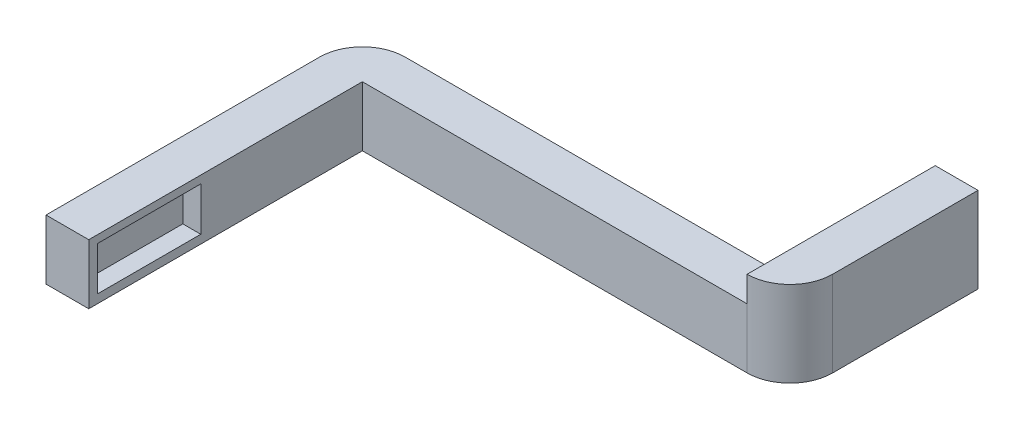
ISO-10303-21;
HEADER;
FILE_DESCRIPTION(('STEP AP214'),'2;1');
FILE_NAME('part.step','',(''),(''),'','','');
FILE_SCHEMA(('AUTOMOTIVE_DESIGN { 1 0 10303 214 1 1 1 1 }'));
ENDSEC;
DATA;
#1=APPLICATION_CONTEXT('core data for automotive mechanical design processes');
#2=APPLICATION_PROTOCOL_DEFINITION('international standard','automotive_design',2000,#1);
#3=PRODUCT_CONTEXT('',#1,'mechanical');
#4=PRODUCT('Part','Part','',(#3));
#5=PRODUCT_RELATED_PRODUCT_CATEGORY('part','',(#4));
#6=PRODUCT_DEFINITION_FORMATION('','',#4);
#7=PRODUCT_DEFINITION_CONTEXT('part definition',#1,'design');
#8=PRODUCT_DEFINITION('design','',#6,#7);
#9=PRODUCT_DEFINITION_SHAPE('','',#8);
#10=(LENGTH_UNIT() NAMED_UNIT(*) SI_UNIT(.MILLI.,.METRE.));
#11=(NAMED_UNIT(*) PLANE_ANGLE_UNIT() SI_UNIT($,.RADIAN.));
#12=(NAMED_UNIT(*) SI_UNIT($,.STERADIAN.) SOLID_ANGLE_UNIT());
#13=UNCERTAINTY_MEASURE_WITH_UNIT(LENGTH_MEASURE(1.E-05),#10,'distance_accuracy_value','');
#14=(GEOMETRIC_REPRESENTATION_CONTEXT(3) GLOBAL_UNCERTAINTY_ASSIGNED_CONTEXT((#13)) GLOBAL_UNIT_ASSIGNED_CONTEXT((#10,
#11,#12)) REPRESENTATION_CONTEXT('',''));
#15=CARTESIAN_POINT('',(0.,0.,0.));
#16=DIRECTION('',(0.,0.,1.));
#17=DIRECTION('',(1.,0.,0.));
#18=AXIS2_PLACEMENT_3D('',#15,#16,#17);
#19=CARTESIAN_POINT('',(22.5,-3.5,-69.));
#20=DIRECTION('',(0.,1.,0.));
#21=DIRECTION('',(-1.,0.,0.));
#22=AXIS2_PLACEMENT_3D('',#19,#20,#21);
#23=PLANE('',#22);
#24=DIRECTION('',(1.,0.,0.));
#25=VECTOR('',#24,1.);
#26=CARTESIAN_POINT('',(22.5,-3.5,-64.));
#27=LINE('',#26,#25);
#28=CARTESIAN_POINT('',(-22.5,-3.5,-64.));
#29=VERTEX_POINT('',#28);
#30=CARTESIAN_POINT('',(22.5,-3.5,-64.));
#31=VERTEX_POINT('',#30);
#32=EDGE_CURVE('E274',#29,#31,#27,.T.);
#33=ORIENTED_EDGE('',*,*,#32,.F.);
#34=DIRECTION('',(0.,0.,-1.));
#35=VECTOR('',#34,1.);
#36=CARTESIAN_POINT('',(-22.5,-3.5,-69.));
#37=LINE('',#36,#35);
#38=CARTESIAN_POINT('',(-22.5,-3.50000000000001,-32.));
#39=VERTEX_POINT('',#38);
#40=EDGE_CURVE('E234',#39,#29,#37,.T.);
#41=ORIENTED_EDGE('',*,*,#40,.F.);
#42=DIRECTION('',(1.,0.,0.));
#43=VECTOR('',#42,1.);
#44=CARTESIAN_POINT('',(-27.5,-3.50000000000001,-32.));
#45=LINE('',#44,#43);
#46=CARTESIAN_POINT('',(-27.5,-3.50000000000001,-32.));
#47=VERTEX_POINT('',#46);
#48=EDGE_CURVE('E241',#47,#39,#45,.T.);
#49=ORIENTED_EDGE('',*,*,#48,.F.);
#50=DIRECTION('',(0.,0.,-1.));
#51=VECTOR('',#50,1.);
#52=CARTESIAN_POINT('',(-27.5,-3.5,-69.));
#53=LINE('',#52,#51);
#54=CARTESIAN_POINT('',(-27.5,-3.5,-64.));
#55=VERTEX_POINT('',#54);
#56=EDGE_CURVE('E237',#47,#55,#53,.T.);
#57=ORIENTED_EDGE('',*,*,#56,.T.);
#58=CARTESIAN_POINT('',(-22.5,-3.5,-64.));
#59=DIRECTION('',(0.,-1.,0.));
#60=DIRECTION('',(-1.,0.,0.));
#61=AXIS2_PLACEMENT_3D('',#58,#59,#60);
#62=CIRCLE('',#61,5.);
#63=CARTESIAN_POINT('',(-22.5,-3.5,-69.));
#64=VERTEX_POINT('',#63);
#65=EDGE_CURVE('E294',#64,#55,#62,.F.);
#66=ORIENTED_EDGE('',*,*,#65,.F.);
#67=DIRECTION('',(1.,0.,0.));
#68=VECTOR('',#67,1.);
#69=CARTESIAN_POINT('',(22.5,-3.5,-69.));
#70=LINE('',#69,#68);
#71=CARTESIAN_POINT('',(22.5,-3.5,-69.));
#72=VERTEX_POINT('',#71);
#73=EDGE_CURVE('E259',#64,#72,#70,.T.);
#74=ORIENTED_EDGE('',*,*,#73,.T.);
#75=DIRECTION('',(0.,0.,1.));
#76=VECTOR('',#75,1.);
#77=CARTESIAN_POINT('',(22.5,-3.5,-64.));
#78=LINE('',#77,#76);
#79=CARTESIAN_POINT('',(22.5,-3.5,-86.));
#80=VERTEX_POINT('',#79);
#81=EDGE_CURVE('E201',#80,#72,#78,.T.);
#82=ORIENTED_EDGE('',*,*,#81,.F.);
#83=DIRECTION('',(-1.,0.,0.));
#84=VECTOR('',#83,1.);
#85=CARTESIAN_POINT('',(27.5,-3.5,-86.));
#86=LINE('',#85,#84);
#87=CARTESIAN_POINT('',(27.5,-3.5,-86.));
#88=VERTEX_POINT('',#87);
#89=EDGE_CURVE('E208',#88,#80,#86,.T.);
#90=ORIENTED_EDGE('',*,*,#89,.F.);
#91=DIRECTION('',(0.,0.,1.));
#92=VECTOR('',#91,1.);
#93=CARTESIAN_POINT('',(27.5,-3.5,-64.));
#94=LINE('',#93,#92);
#95=CARTESIAN_POINT('',(27.5,-3.5,-69.));
#96=VERTEX_POINT('',#95);
#97=EDGE_CURVE('E204',#88,#96,#94,.T.);
#98=ORIENTED_EDGE('',*,*,#97,.T.);
#99=CARTESIAN_POINT('',(22.5,-3.5,-69.));
#100=DIRECTION('',(0.,-1.,0.));
#101=DIRECTION('',(-1.,0.,0.));
#102=AXIS2_PLACEMENT_3D('',#99,#100,#101);
#103=CIRCLE('',#102,5.);
#104=EDGE_CURVE('E11',#31,#96,#103,.F.);
#105=ORIENTED_EDGE('',*,*,#104,.F.);
#106=EDGE_LOOP('',(#33,#41,#49,#57,#66,#74,#82,#90,#98,#105));
#107=FACE_BOUND('',#106,.T.);
#108=ADVANCED_FACE('F42',(#107),#23,.F.);
#109=CARTESIAN_POINT('',(22.5,3.5,-69.));
#110=DIRECTION('',(0.,-1.,0.));
#111=DIRECTION('',(1.,0.,0.));
#112=AXIS2_PLACEMENT_3D('',#109,#110,#111);
#113=PLANE('',#112);
#114=DIRECTION('',(0.,0.,1.));
#115=VECTOR('',#114,1.);
#116=CARTESIAN_POINT('',(-27.5,3.5,-69.));
#117=LINE('',#116,#115);
#118=CARTESIAN_POINT('',(-27.5,3.5,-64.));
#119=VERTEX_POINT('',#118);
#120=CARTESIAN_POINT('',(-27.5,3.49999999999999,-32.));
#121=VERTEX_POINT('',#120);
#122=EDGE_CURVE('E229',#119,#121,#117,.T.);
#123=ORIENTED_EDGE('',*,*,#122,.T.);
#124=DIRECTION('',(1.,0.,0.));
#125=VECTOR('',#124,1.);
#126=CARTESIAN_POINT('',(-27.5,3.49999999999999,-32.));
#127=LINE('',#126,#125);
#128=CARTESIAN_POINT('',(-22.5,3.49999999999999,-32.));
#129=VERTEX_POINT('',#128);
#130=EDGE_CURVE('E254',#121,#129,#127,.T.);
#131=ORIENTED_EDGE('',*,*,#130,.T.);
#132=DIRECTION('',(0.,0.,1.));
#133=VECTOR('',#132,1.);
#134=CARTESIAN_POINT('',(-22.5,3.5,-69.));
#135=LINE('',#134,#133);
#136=CARTESIAN_POINT('',(-22.5,3.5,-64.));
#137=VERTEX_POINT('',#136);
#138=EDGE_CURVE('E228',#137,#129,#135,.T.);
#139=ORIENTED_EDGE('',*,*,#138,.F.);
#140=DIRECTION('',(-1.,0.,0.));
#141=VECTOR('',#140,1.);
#142=CARTESIAN_POINT('',(22.5,3.5,-64.));
#143=LINE('',#142,#141);
#144=CARTESIAN_POINT('',(22.5,3.5,-64.));
#145=VERTEX_POINT('',#144);
#146=EDGE_CURVE('E264',#145,#137,#143,.T.);
#147=ORIENTED_EDGE('',*,*,#146,.F.);
#148=DIRECTION('',(0.,0.,1.));
#149=VECTOR('',#148,1.);
#150=CARTESIAN_POINT('',(22.5,3.5,-69.));
#151=LINE('',#150,#149);
#152=CARTESIAN_POINT('',(22.5,3.5,-69.));
#153=VERTEX_POINT('',#152);
#154=EDGE_CURVE('E271',#153,#145,#151,.T.);
#155=ORIENTED_EDGE('',*,*,#154,.F.);
#156=DIRECTION('',(-1.,0.,0.));
#157=VECTOR('',#156,1.);
#158=CARTESIAN_POINT('',(22.5,3.5,-69.));
#159=LINE('',#158,#157);
#160=CARTESIAN_POINT('',(-22.5,3.5,-69.));
#161=VERTEX_POINT('',#160);
#162=EDGE_CURVE('E267',#153,#161,#159,.T.);
#163=ORIENTED_EDGE('',*,*,#162,.T.);
#164=CARTESIAN_POINT('',(-22.5,3.5,-64.));
#165=DIRECTION('',(0.,1.,0.));
#166=DIRECTION('',(1.,0.,0.));
#167=AXIS2_PLACEMENT_3D('',#164,#165,#166);
#168=CIRCLE('',#167,5.);
#169=EDGE_CURVE('E287',#119,#161,#168,.F.);
#170=ORIENTED_EDGE('',*,*,#169,.F.);
#171=EDGE_LOOP('',(#123,#131,#139,#147,#155,#163,#170));
#172=FACE_BOUND('',#171,.T.);
#173=ADVANCED_FACE('F318',(#172),#113,.F.);
#174=CARTESIAN_POINT('',(0.,0.,-69.));
#175=DIRECTION('',(0.,0.,1.));
#176=DIRECTION('',(-1.,0.,0.));
#177=AXIS2_PLACEMENT_3D('',#174,#175,#176);
#178=PLANE('',#177);
#179=ORIENTED_EDGE('',*,*,#162,.F.);
#180=DIRECTION('',(0.,1.,0.));
#181=VECTOR('',#180,1.);
#182=CARTESIAN_POINT('',(22.5,3.5,-69.));
#183=LINE('',#182,#181);
#184=EDGE_CURVE('E263',#72,#153,#183,.T.);
#185=ORIENTED_EDGE('',*,*,#184,.F.);
#186=ORIENTED_EDGE('',*,*,#73,.F.);
#187=DIRECTION('',(0.,1.,0.));
#188=VECTOR('',#187,1.);
#189=CARTESIAN_POINT('',(-22.5,0.,-69.));
#190=LINE('',#189,#188);
#191=EDGE_CURVE('E291',#161,#64,#190,.F.);
#192=ORIENTED_EDGE('',*,*,#191,.F.);
#193=EDGE_LOOP('',(#179,#185,#186,#192));
#194=FACE_BOUND('',#193,.T.);
#195=ADVANCED_FACE('F335',(#194),#178,.F.);
#196=CARTESIAN_POINT('',(0.,0.,-64.));
#197=DIRECTION('',(0.,0.,1.));
#198=DIRECTION('',(-1.,0.,0.));
#199=AXIS2_PLACEMENT_3D('',#196,#197,#198);
#200=PLANE('',#199);
#201=ORIENTED_EDGE('',*,*,#146,.T.);
#202=DIRECTION('',(0.,-1.,0.));
#203=VECTOR('',#202,1.);
#204=CARTESIAN_POINT('',(-22.5,3.5,-64.));
#205=LINE('',#204,#203);
#206=EDGE_CURVE('E258',#137,#29,#205,.T.);
#207=ORIENTED_EDGE('',*,*,#206,.T.);
#208=ORIENTED_EDGE('',*,*,#32,.T.);
#209=DIRECTION('',(0.,1.,0.));
#210=VECTOR('',#209,1.);
#211=CARTESIAN_POINT('',(22.5,-3.5,-64.));
#212=LINE('',#211,#210);
#213=EDGE_CURVE('E51',#145,#31,#212,.F.);
#214=ORIENTED_EDGE('',*,*,#213,.F.);
#215=EDGE_LOOP('',(#201,#207,#208,#214));
#216=FACE_BOUND('',#215,.T.);
#217=ADVANCED_FACE('F320',(#216),#200,.T.);
#218=CARTESIAN_POINT('',(-27.5,3.49999999999999,-32.));
#219=DIRECTION('',(0.,0.,-1.));
#220=DIRECTION('',(1.,0.,0.));
#221=AXIS2_PLACEMENT_3D('',#218,#219,#220);
#222=PLANE('',#221);
#223=DIRECTION('',(0.,-1.,0.));
#224=VECTOR('',#223,1.);
#225=CARTESIAN_POINT('',(-22.5,3.49999999999999,-32.));
#226=LINE('',#225,#224);
#227=EDGE_CURVE('E245',#129,#39,#226,.T.);
#228=ORIENTED_EDGE('',*,*,#227,.F.);
#229=ORIENTED_EDGE('',*,*,#130,.F.);
#230=DIRECTION('',(0.,-1.,0.));
#231=VECTOR('',#230,1.);
#232=CARTESIAN_POINT('',(-27.5,3.49999999999999,-32.));
#233=LINE('',#232,#231);
#234=EDGE_CURVE('E233',#121,#47,#233,.T.);
#235=ORIENTED_EDGE('',*,*,#234,.T.);
#236=ORIENTED_EDGE('',*,*,#48,.T.);
#237=EDGE_LOOP('',(#228,#229,#235,#236));
#238=FACE_BOUND('',#237,.T.);
#239=ADVANCED_FACE('F344',(#238),#222,.F.);
#240=CARTESIAN_POINT('',(-27.5,0.,-64.));
#241=DIRECTION('',(1.,0.,0.));
#242=DIRECTION('',(0.,0.,1.));
#243=AXIS2_PLACEMENT_3D('',#240,#241,#242);
#244=PLANE('',#243);
#245=ORIENTED_EDGE('',*,*,#56,.F.);
#246=ORIENTED_EDGE('',*,*,#234,.F.);
#247=ORIENTED_EDGE('',*,*,#122,.F.);
#248=DIRECTION('',(0.,1.,0.));
#249=VECTOR('',#248,1.);
#250=CARTESIAN_POINT('',(-27.5,0.,-64.));
#251=LINE('',#250,#249);
#252=EDGE_CURVE('E284',#55,#119,#251,.T.);
#253=ORIENTED_EDGE('',*,*,#252,.F.);
#254=EDGE_LOOP('',(#245,#246,#247,#253));
#255=FACE_BOUND('',#254,.T.);
#256=ADVANCED_FACE('F341',(#255),#244,.F.);
#257=CARTESIAN_POINT('',(-22.5,0.,-64.));
#258=DIRECTION('',(1.,0.,0.));
#259=DIRECTION('',(0.,0.,1.));
#260=AXIS2_PLACEMENT_3D('',#257,#258,#259);
#261=PLANE('',#260);
#262=DIRECTION('',(0.,-1.,0.));
#263=VECTOR('',#262,1.);
#264=CARTESIAN_POINT('',(-22.5,2.59999999999999,-45.1));
#265=LINE('',#264,#263);
#266=CARTESIAN_POINT('',(-22.5,2.59999999999999,-45.1));
#267=VERTEX_POINT('',#266);
#268=CARTESIAN_POINT('',(-22.5,-2.50000000000001,-45.1));
#269=VERTEX_POINT('',#268);
#270=EDGE_CURVE('E180',#267,#269,#265,.T.);
#271=ORIENTED_EDGE('',*,*,#270,.T.);
#272=DIRECTION('',(0.,0.,1.));
#273=VECTOR('',#272,1.);
#274=CARTESIAN_POINT('',(-22.5,-2.50000000000001,-33.));
#275=LINE('',#274,#273);
#276=CARTESIAN_POINT('',(-22.5,-2.50000000000001,-33.));
#277=VERTEX_POINT('',#276);
#278=EDGE_CURVE('E160',#269,#277,#275,.T.);
#279=ORIENTED_EDGE('',*,*,#278,.T.);
#280=DIRECTION('',(0.,1.,0.));
#281=VECTOR('',#280,1.);
#282=CARTESIAN_POINT('',(-22.5,2.59999999999999,-33.));
#283=LINE('',#282,#281);
#284=CARTESIAN_POINT('',(-22.5,2.59999999999999,-33.));
#285=VERTEX_POINT('',#284);
#286=EDGE_CURVE('E173',#277,#285,#283,.T.);
#287=ORIENTED_EDGE('',*,*,#286,.T.);
#288=DIRECTION('',(0.,0.,-1.));
#289=VECTOR('',#288,1.);
#290=CARTESIAN_POINT('',(-22.5,2.59999999999999,-33.));
#291=LINE('',#290,#289);
#292=EDGE_CURVE('E169',#285,#267,#291,.T.);
#293=ORIENTED_EDGE('',*,*,#292,.T.);
#294=EDGE_LOOP('',(#271,#279,#287,#293));
#295=FACE_BOUND('',#294,.T.);
#296=ORIENTED_EDGE('',*,*,#138,.T.);
#297=ORIENTED_EDGE('',*,*,#227,.T.);
#298=ORIENTED_EDGE('',*,*,#40,.T.);
#299=ORIENTED_EDGE('',*,*,#206,.F.);
#300=EDGE_LOOP('',(#296,#297,#298,#299));
#301=FACE_BOUND('',#300,.T.);
#302=ADVANCED_FACE('F346',(#295,#301),#261,.T.);
#303=CARTESIAN_POINT('',(-22.5,0.,-64.));
#304=DIRECTION('',(0.,1.,0.));
#305=DIRECTION('',(0.,0.,-1.));
#306=AXIS2_PLACEMENT_3D('',#303,#304,#305);
#307=CYLINDRICAL_SURFACE('',#306,5.);
#308=ORIENTED_EDGE('',*,*,#65,.T.);
#309=ORIENTED_EDGE('',*,*,#252,.T.);
#310=ORIENTED_EDGE('',*,*,#169,.T.);
#311=ORIENTED_EDGE('',*,*,#191,.T.);
#312=EDGE_LOOP('',(#308,#309,#310,#311));
#313=FACE_BOUND('',#312,.T.);
#314=ADVANCED_FACE('F348',(#313),#307,.T.);
#315=CARTESIAN_POINT('',(22.5,0.,-64.));
#316=DIRECTION('',(-1.,0.,0.));
#317=DIRECTION('',(0.,0.,-1.));
#318=AXIS2_PLACEMENT_3D('',#315,#316,#317);
#319=PLANE('',#318);
#320=ORIENTED_EDGE('',*,*,#154,.T.);
#321=DIRECTION('',(0.,1.,0.));
#322=VECTOR('',#321,1.);
#323=CARTESIAN_POINT('',(22.5,6.5,-64.));
#324=LINE('',#323,#322);
#325=CARTESIAN_POINT('',(22.5,6.5,-64.));
#326=VERTEX_POINT('',#325);
#327=EDGE_CURVE('E190',#145,#326,#324,.T.);
#328=ORIENTED_EDGE('',*,*,#327,.T.);
#329=DIRECTION('',(0.,0.,-1.));
#330=VECTOR('',#329,1.);
#331=CARTESIAN_POINT('',(22.5,6.5,-64.));
#332=LINE('',#331,#330);
#333=CARTESIAN_POINT('',(22.5,6.5,-86.));
#334=VERTEX_POINT('',#333);
#335=EDGE_CURVE('E212',#326,#334,#332,.T.);
#336=ORIENTED_EDGE('',*,*,#335,.T.);
#337=DIRECTION('',(0.,-1.,0.));
#338=VECTOR('',#337,1.);
#339=CARTESIAN_POINT('',(22.5,6.5,-86.));
#340=LINE('',#339,#338);
#341=EDGE_CURVE('E216',#334,#80,#340,.T.);
#342=ORIENTED_EDGE('',*,*,#341,.T.);
#343=ORIENTED_EDGE('',*,*,#81,.T.);
#344=ORIENTED_EDGE('',*,*,#184,.T.);
#345=EDGE_LOOP('',(#320,#328,#336,#342,#343,#344));
#346=FACE_BOUND('',#345,.T.);
#347=ADVANCED_FACE('F312',(#346),#319,.T.);
#348=CARTESIAN_POINT('',(27.5,6.5,-64.));
#349=DIRECTION('',(0.,-1.,0.));
#350=DIRECTION('',(0.,0.,1.));
#351=AXIS2_PLACEMENT_3D('',#348,#349,#350);
#352=PLANE('',#351);
#353=DIRECTION('',(0.,0.,-1.));
#354=VECTOR('',#353,1.);
#355=CARTESIAN_POINT('',(27.5,6.5,-64.));
#356=LINE('',#355,#354);
#357=CARTESIAN_POINT('',(27.5,6.5,-69.));
#358=VERTEX_POINT('',#357);
#359=CARTESIAN_POINT('',(27.5,6.5,-86.));
#360=VERTEX_POINT('',#359);
#361=EDGE_CURVE('E196',#358,#360,#356,.T.);
#362=ORIENTED_EDGE('',*,*,#361,.T.);
#363=DIRECTION('',(-1.,0.,0.));
#364=VECTOR('',#363,1.);
#365=CARTESIAN_POINT('',(27.5,6.5,-86.));
#366=LINE('',#365,#364);
#367=EDGE_CURVE('E225',#360,#334,#366,.T.);
#368=ORIENTED_EDGE('',*,*,#367,.T.);
#369=ORIENTED_EDGE('',*,*,#335,.F.);
#370=CARTESIAN_POINT('',(22.5,6.5,-69.));
#371=DIRECTION('',(0.,1.,0.));
#372=DIRECTION('',(0.,0.,1.));
#373=AXIS2_PLACEMENT_3D('',#370,#371,#372);
#374=CIRCLE('',#373,5.);
#375=EDGE_CURVE('E301',#358,#326,#374,.F.);
#376=ORIENTED_EDGE('',*,*,#375,.F.);
#377=EDGE_LOOP('',(#362,#368,#369,#376));
#378=FACE_BOUND('',#377,.T.);
#379=ADVANCED_FACE('F308',(#378),#352,.F.);
#380=CARTESIAN_POINT('',(27.5,6.5,-86.));
#381=DIRECTION('',(0.,0.,1.));
#382=DIRECTION('',(-1.,0.,0.));
#383=AXIS2_PLACEMENT_3D('',#380,#381,#382);
#384=PLANE('',#383);
#385=ORIENTED_EDGE('',*,*,#341,.F.);
#386=ORIENTED_EDGE('',*,*,#367,.F.);
#387=DIRECTION('',(0.,-1.,0.));
#388=VECTOR('',#387,1.);
#389=CARTESIAN_POINT('',(27.5,6.5,-86.));
#390=LINE('',#389,#388);
#391=EDGE_CURVE('E200',#360,#88,#390,.T.);
#392=ORIENTED_EDGE('',*,*,#391,.T.);
#393=ORIENTED_EDGE('',*,*,#89,.T.);
#394=EDGE_LOOP('',(#385,#386,#392,#393));
#395=FACE_BOUND('',#394,.T.);
#396=ADVANCED_FACE('F331',(#395),#384,.F.);
#397=CARTESIAN_POINT('',(27.5,0.,-64.));
#398=DIRECTION('',(-1.,0.,0.));
#399=DIRECTION('',(0.,0.,-1.));
#400=AXIS2_PLACEMENT_3D('',#397,#398,#399);
#401=PLANE('',#400);
#402=ORIENTED_EDGE('',*,*,#97,.F.);
#403=ORIENTED_EDGE('',*,*,#391,.F.);
#404=ORIENTED_EDGE('',*,*,#361,.F.);
#405=DIRECTION('',(0.,1.,0.));
#406=VECTOR('',#405,1.);
#407=CARTESIAN_POINT('',(27.5,6.5,-69.));
#408=LINE('',#407,#406);
#409=EDGE_CURVE('E298',#96,#358,#408,.T.);
#410=ORIENTED_EDGE('',*,*,#409,.F.);
#411=EDGE_LOOP('',(#402,#403,#404,#410));
#412=FACE_BOUND('',#411,.T.);
#413=ADVANCED_FACE('F329',(#412),#401,.F.);
#414=CARTESIAN_POINT('',(22.5,0.,-69.));
#415=DIRECTION('',(0.,-1.,0.));
#416=DIRECTION('',(0.,0.,1.));
#417=AXIS2_PLACEMENT_3D('',#414,#415,#416);
#418=CYLINDRICAL_SURFACE('',#417,5.);
#419=ORIENTED_EDGE('',*,*,#213,.T.);
#420=ORIENTED_EDGE('',*,*,#104,.T.);
#421=ORIENTED_EDGE('',*,*,#409,.T.);
#422=ORIENTED_EDGE('',*,*,#375,.T.);
#423=ORIENTED_EDGE('',*,*,#327,.F.);
#424=EDGE_LOOP('',(#419,#420,#421,#422,#423));
#425=FACE_BOUND('',#424,.T.);
#426=ADVANCED_FACE('F44',(#425),#418,.T.);
#427=CARTESIAN_POINT('',(-24.6,2.59999999999999,-45.1));
#428=DIRECTION('',(0.,0.,-1.));
#429=DIRECTION('',(1.,0.,0.));
#430=AXIS2_PLACEMENT_3D('',#427,#428,#429);
#431=PLANE('',#430);
#432=ORIENTED_EDGE('',*,*,#270,.F.);
#433=DIRECTION('',(1.,0.,0.));
#434=VECTOR('',#433,1.);
#435=CARTESIAN_POINT('',(-24.6,2.59999999999999,-45.1));
#436=LINE('',#435,#434);
#437=CARTESIAN_POINT('',(-24.6,2.59999999999999,-45.1));
#438=VERTEX_POINT('',#437);
#439=EDGE_CURVE('E167',#438,#267,#436,.T.);
#440=ORIENTED_EDGE('',*,*,#439,.F.);
#441=DIRECTION('',(0.,-1.,0.));
#442=VECTOR('',#441,1.);
#443=CARTESIAN_POINT('',(-24.6,2.59999999999999,-45.1));
#444=LINE('',#443,#442);
#445=CARTESIAN_POINT('',(-24.6,-2.50000000000001,-45.1));
#446=VERTEX_POINT('',#445);
#447=EDGE_CURVE('E151',#438,#446,#444,.T.);
#448=ORIENTED_EDGE('',*,*,#447,.T.);
#449=DIRECTION('',(1.,0.,0.));
#450=VECTOR('',#449,1.);
#451=CARTESIAN_POINT('',(-24.6,-2.50000000000001,-45.1));
#452=LINE('',#451,#450);
#453=EDGE_CURVE('E58',#446,#269,#452,.T.);
#454=ORIENTED_EDGE('',*,*,#453,.T.);
#455=EDGE_LOOP('',(#432,#440,#448,#454));
#456=FACE_BOUND('',#455,.T.);
#457=ADVANCED_FACE('F166',(#456),#431,.F.);
#458=CARTESIAN_POINT('',(-24.6,2.59999999999999,-33.));
#459=DIRECTION('',(0.,1.,0.));
#460=DIRECTION('',(0.,0.,-1.));
#461=AXIS2_PLACEMENT_3D('',#458,#459,#460);
#462=PLANE('',#461);
#463=ORIENTED_EDGE('',*,*,#292,.F.);
#464=DIRECTION('',(1.,0.,0.));
#465=VECTOR('',#464,1.);
#466=CARTESIAN_POINT('',(-24.6,2.59999999999999,-33.));
#467=LINE('',#466,#465);
#468=CARTESIAN_POINT('',(-24.6,2.59999999999999,-33.));
#469=VERTEX_POINT('',#468);
#470=EDGE_CURVE('E191',#469,#285,#467,.T.);
#471=ORIENTED_EDGE('',*,*,#470,.F.);
#472=DIRECTION('',(0.,0.,-1.));
#473=VECTOR('',#472,1.);
#474=CARTESIAN_POINT('',(-24.6,2.59999999999999,-33.));
#475=LINE('',#474,#473);
#476=EDGE_CURVE('E164',#469,#438,#475,.T.);
#477=ORIENTED_EDGE('',*,*,#476,.T.);
#478=ORIENTED_EDGE('',*,*,#439,.T.);
#479=EDGE_LOOP('',(#463,#471,#477,#478));
#480=FACE_BOUND('',#479,.T.);
#481=ADVANCED_FACE('F448',(#480),#462,.F.);
#482=CARTESIAN_POINT('',(-24.6,2.59999999999999,-33.));
#483=DIRECTION('',(0.,0.,1.));
#484=DIRECTION('',(0.,1.,0.));
#485=AXIS2_PLACEMENT_3D('',#482,#483,#484);
#486=PLANE('',#485);
#487=ORIENTED_EDGE('',*,*,#286,.F.);
#488=DIRECTION('',(1.,0.,0.));
#489=VECTOR('',#488,1.);
#490=CARTESIAN_POINT('',(-24.6,-2.50000000000001,-33.));
#491=LINE('',#490,#489);
#492=CARTESIAN_POINT('',(-24.6,-2.50000000000001,-33.));
#493=VERTEX_POINT('',#492);
#494=EDGE_CURVE('E163',#493,#277,#491,.T.);
#495=ORIENTED_EDGE('',*,*,#494,.F.);
#496=DIRECTION('',(0.,1.,0.));
#497=VECTOR('',#496,1.);
#498=CARTESIAN_POINT('',(-24.6,2.59999999999999,-33.));
#499=LINE('',#498,#497);
#500=EDGE_CURVE('E153',#493,#469,#499,.T.);
#501=ORIENTED_EDGE('',*,*,#500,.T.);
#502=ORIENTED_EDGE('',*,*,#470,.T.);
#503=EDGE_LOOP('',(#487,#495,#501,#502));
#504=FACE_BOUND('',#503,.T.);
#505=ADVANCED_FACE('F459',(#504),#486,.F.);
#506=CARTESIAN_POINT('',(-24.6,-2.50000000000001,-33.));
#507=DIRECTION('',(0.,-1.,0.));
#508=DIRECTION('',(0.,0.,1.));
#509=AXIS2_PLACEMENT_3D('',#506,#507,#508);
#510=PLANE('',#509);
#511=ORIENTED_EDGE('',*,*,#278,.F.);
#512=ORIENTED_EDGE('',*,*,#453,.F.);
#513=DIRECTION('',(0.,0.,1.));
#514=VECTOR('',#513,1.);
#515=CARTESIAN_POINT('',(-24.6,-2.50000000000001,-33.));
#516=LINE('',#515,#514);
#517=EDGE_CURVE('E148',#446,#493,#516,.T.);
#518=ORIENTED_EDGE('',*,*,#517,.T.);
#519=ORIENTED_EDGE('',*,*,#494,.T.);
#520=EDGE_LOOP('',(#511,#512,#518,#519));
#521=FACE_BOUND('',#520,.T.);
#522=ADVANCED_FACE('F158',(#521),#510,.F.);
#523=CARTESIAN_POINT('',(-24.6,0.,-64.));
#524=DIRECTION('',(-1.,0.,0.));
#525=DIRECTION('',(0.,0.,-1.));
#526=AXIS2_PLACEMENT_3D('',#523,#524,#525);
#527=PLANE('',#526);
#528=ORIENTED_EDGE('',*,*,#447,.F.);
#529=ORIENTED_EDGE('',*,*,#476,.F.);
#530=ORIENTED_EDGE('',*,*,#500,.F.);
#531=ORIENTED_EDGE('',*,*,#517,.F.);
#532=EDGE_LOOP('',(#528,#529,#530,#531));
#533=FACE_BOUND('',#532,.T.);
#534=ADVANCED_FACE('F149',(#533),#527,.F.);
#535=CLOSED_SHELL('',(#108,#173,#195,#217,#239,#256,#302,#314,#347,#379,#396,#413,#426,#457,
#481,#505,#522,#534));
#536=MANIFOLD_SOLID_BREP('B2',#535);
#537=ADVANCED_BREP_SHAPE_REPRESENTATION('',(#18,#536),#14);
#538=SHAPE_DEFINITION_REPRESENTATION(#9,#537);
ENDSEC;
END-ISO-10303-21;
